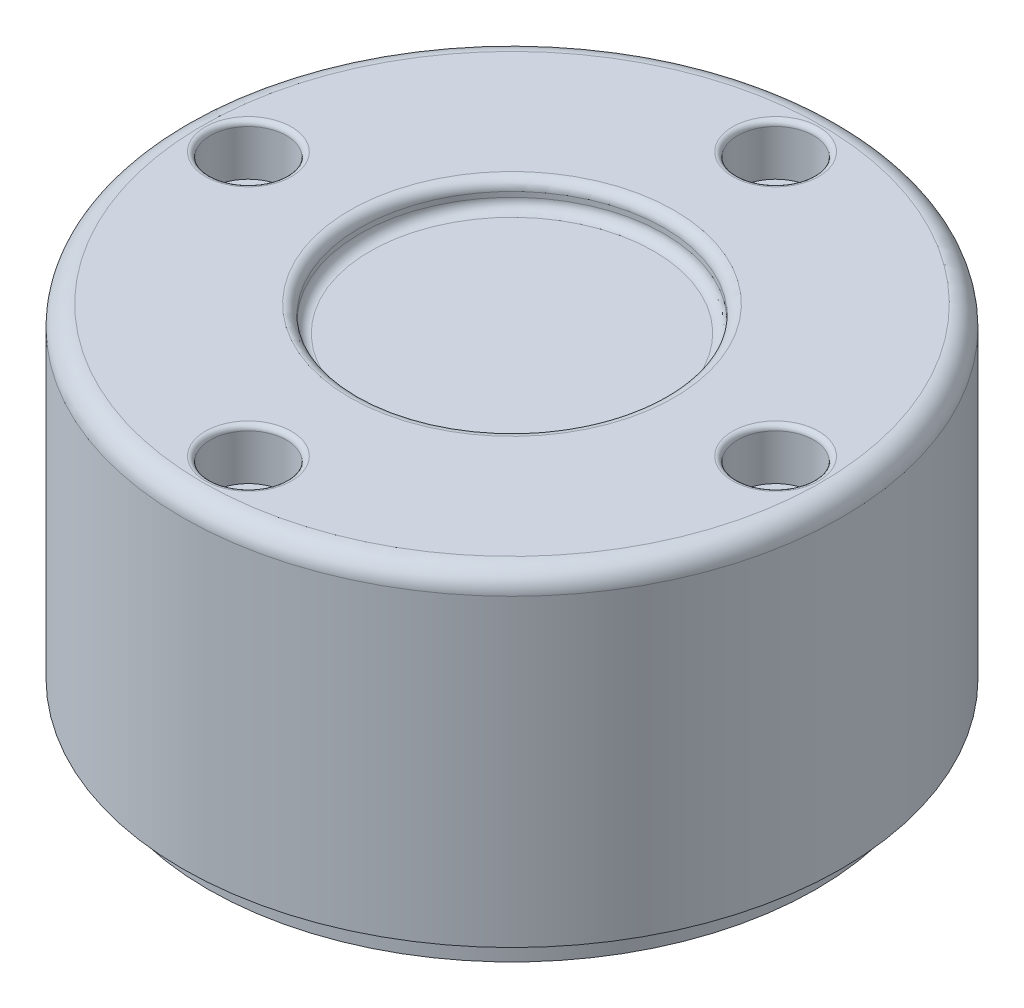
ISO-10303-21;
HEADER;
FILE_DESCRIPTION(('STEP AP214'),'2;1');
FILE_NAME('part.step','',(''),(''),'','','');
FILE_SCHEMA(('AUTOMOTIVE_DESIGN { 1 0 10303 214 1 1 1 1 }'));
ENDSEC;
DATA;
#1=APPLICATION_CONTEXT('core data for automotive mechanical design processes');
#2=APPLICATION_PROTOCOL_DEFINITION('international standard','automotive_design',2000,#1);
#3=PRODUCT_CONTEXT('',#1,'mechanical');
#4=PRODUCT('Part','Part','',(#3));
#5=PRODUCT_RELATED_PRODUCT_CATEGORY('part','',(#4));
#6=PRODUCT_DEFINITION_FORMATION('','',#4);
#7=PRODUCT_DEFINITION_CONTEXT('part definition',#1,'design');
#8=PRODUCT_DEFINITION('design','',#6,#7);
#9=PRODUCT_DEFINITION_SHAPE('','',#8);
#10=(LENGTH_UNIT() NAMED_UNIT(*) SI_UNIT(.MILLI.,.METRE.));
#11=(NAMED_UNIT(*) PLANE_ANGLE_UNIT() SI_UNIT($,.RADIAN.));
#12=(NAMED_UNIT(*) SI_UNIT($,.STERADIAN.) SOLID_ANGLE_UNIT());
#13=UNCERTAINTY_MEASURE_WITH_UNIT(LENGTH_MEASURE(1.E-05),#10,'distance_accuracy_value','');
#14=(GEOMETRIC_REPRESENTATION_CONTEXT(3) GLOBAL_UNCERTAINTY_ASSIGNED_CONTEXT((#13)) GLOBAL_UNIT_ASSIGNED_CONTEXT((#10,
#11,#12)) REPRESENTATION_CONTEXT('',''));
#15=CARTESIAN_POINT('',(0.,0.,0.));
#16=DIRECTION('',(0.,0.,1.));
#17=DIRECTION('',(1.,0.,0.));
#18=AXIS2_PLACEMENT_3D('',#15,#16,#17);
#19=CARTESIAN_POINT('',(0.,3.,0.));
#20=DIRECTION('',(0.,-1.,0.));
#21=DIRECTION('',(0.,0.,-1.));
#22=AXIS2_PLACEMENT_3D('',#19,#20,#21);
#23=CYLINDRICAL_SURFACE('',#22,30.);
#24=CARTESIAN_POINT('',(0.,3.,0.));
#25=DIRECTION('',(0.,1.,0.));
#26=DIRECTION('',(0.,0.,1.));
#27=AXIS2_PLACEMENT_3D('',#24,#25,#26);
#28=CIRCLE('',#27,30.);
#29=CARTESIAN_POINT('',(0.,3.,30.));
#30=VERTEX_POINT('',#29);
#31=EDGE_CURVE('E92',#30,#30,#28,.T.);
#32=ORIENTED_EDGE('',*,*,#31,.F.);
#33=EDGE_LOOP('',(#32));
#34=FACE_BOUND('',#33,.T.);
#35=CARTESIAN_POINT('',(0.,0.,0.));
#36=DIRECTION('',(0.,1.,0.));
#37=DIRECTION('',(0.,0.,1.));
#38=AXIS2_PLACEMENT_3D('',#35,#36,#37);
#39=CIRCLE('',#38,30.);
#40=CARTESIAN_POINT('',(0.,0.,30.));
#41=VERTEX_POINT('',#40);
#42=EDGE_CURVE('E93',#41,#41,#39,.T.);
#43=ORIENTED_EDGE('',*,*,#42,.T.);
#44=EDGE_LOOP('',(#43));
#45=FACE_BOUND('',#44,.T.);
#46=ADVANCED_FACE('F42',(#34,#45),#23,.T.);
#47=CARTESIAN_POINT('',(0.,0.,0.));
#48=DIRECTION('',(0.,1.,0.));
#49=DIRECTION('',(0.,0.,1.));
#50=AXIS2_PLACEMENT_3D('',#47,#48,#49);
#51=PLANE('',#50);
#52=ORIENTED_EDGE('',*,*,#42,.F.);
#53=EDGE_LOOP('',(#52));
#54=FACE_BOUND('',#53,.T.);
#55=ADVANCED_FACE('F131',(#54),#51,.F.);
#56=CARTESIAN_POINT('',(0.,35.,0.));
#57=DIRECTION('',(0.,-1.,0.));
#58=DIRECTION('',(0.,0.,-1.));
#59=AXIS2_PLACEMENT_3D('',#56,#57,#58);
#60=CYLINDRICAL_SURFACE('',#59,32.5);
#61=CARTESIAN_POINT('',(0.,33.,0.));
#62=DIRECTION('',(0.,1.,0.));
#63=DIRECTION('',(0.,0.,1.));
#64=AXIS2_PLACEMENT_3D('',#61,#62,#63);
#65=CIRCLE('',#64,32.5);
#66=CARTESIAN_POINT('',(0.,33.,32.5));
#67=VERTEX_POINT('',#66);
#68=EDGE_CURVE('E74',#67,#67,#65,.F.);
#69=ORIENTED_EDGE('',*,*,#68,.T.);
#70=EDGE_LOOP('',(#69));
#71=FACE_BOUND('',#70,.T.);
#72=CARTESIAN_POINT('',(0.,3.,0.));
#73=DIRECTION('',(0.,1.,0.));
#74=DIRECTION('',(0.,0.,1.));
#75=AXIS2_PLACEMENT_3D('',#72,#73,#74);
#76=CIRCLE('',#75,32.5);
#77=CARTESIAN_POINT('',(0.,3.,32.5));
#78=VERTEX_POINT('',#77);
#79=EDGE_CURVE('E96',#78,#78,#76,.T.);
#80=ORIENTED_EDGE('',*,*,#79,.T.);
#81=EDGE_LOOP('',(#80));
#82=FACE_BOUND('',#81,.T.);
#83=ADVANCED_FACE('F137',(#71,#82),#60,.T.);
#84=CARTESIAN_POINT('',(0.,35.,0.));
#85=DIRECTION('',(0.,1.,0.));
#86=DIRECTION('',(0.,0.,1.));
#87=AXIS2_PLACEMENT_3D('',#84,#85,#86);
#88=PLANE('',#87);
#89=CARTESIAN_POINT('',(26.,35.,0.));
#90=DIRECTION('',(0.,1.,0.));
#91=DIRECTION('',(0.,0.,1.));
#92=AXIS2_PLACEMENT_3D('',#89,#90,#91);
#93=CIRCLE('',#92,4.25);
#94=CARTESIAN_POINT('',(26.,35.,4.25));
#95=VERTEX_POINT('',#94);
#96=EDGE_CURVE('E57',#95,#95,#93,.F.);
#97=ORIENTED_EDGE('',*,*,#96,.T.);
#98=EDGE_LOOP('',(#97));
#99=FACE_BOUND('',#98,.T.);
#100=CARTESIAN_POINT('',(0.,35.,-26.));
#101=DIRECTION('',(0.,1.,0.));
#102=DIRECTION('',(0.,0.,1.));
#103=AXIS2_PLACEMENT_3D('',#100,#101,#102);
#104=CIRCLE('',#103,4.25);
#105=CARTESIAN_POINT('',(0.,35.,-21.75));
#106=VERTEX_POINT('',#105);
#107=EDGE_CURVE('E62',#106,#106,#104,.F.);
#108=ORIENTED_EDGE('',*,*,#107,.T.);
#109=EDGE_LOOP('',(#108));
#110=FACE_BOUND('',#109,.T.);
#111=CARTESIAN_POINT('',(-26.,35.,0.));
#112=DIRECTION('',(0.,1.,0.));
#113=DIRECTION('',(0.,0.,1.));
#114=AXIS2_PLACEMENT_3D('',#111,#112,#113);
#115=CIRCLE('',#114,4.25);
#116=CARTESIAN_POINT('',(-26.,35.,4.25000000000001));
#117=VERTEX_POINT('',#116);
#118=EDGE_CURVE('E65',#117,#117,#115,.F.);
#119=ORIENTED_EDGE('',*,*,#118,.T.);
#120=EDGE_LOOP('',(#119));
#121=FACE_BOUND('',#120,.T.);
#122=CARTESIAN_POINT('',(0.,35.,26.));
#123=DIRECTION('',(0.,1.,0.));
#124=DIRECTION('',(0.,0.,1.));
#125=AXIS2_PLACEMENT_3D('',#122,#123,#124);
#126=CIRCLE('',#125,4.25000000000001);
#127=CARTESIAN_POINT('',(0.,35.,30.25));
#128=VERTEX_POINT('',#127);
#129=EDGE_CURVE('E68',#128,#128,#126,.F.);
#130=ORIENTED_EDGE('',*,*,#129,.T.);
#131=EDGE_LOOP('',(#130));
#132=FACE_BOUND('',#131,.T.);
#133=CARTESIAN_POINT('',(0.,35.,0.));
#134=DIRECTION('',(0.,1.,0.));
#135=DIRECTION('',(0.,0.,1.));
#136=AXIS2_PLACEMENT_3D('',#133,#134,#135);
#137=CIRCLE('',#136,30.5);
#138=CARTESIAN_POINT('',(0.,35.,30.5));
#139=VERTEX_POINT('',#138);
#140=EDGE_CURVE('E77',#139,#139,#137,.T.);
#141=ORIENTED_EDGE('',*,*,#140,.T.);
#142=EDGE_LOOP('',(#141));
#143=FACE_BOUND('',#142,.T.);
#144=CARTESIAN_POINT('',(0.,35.,0.));
#145=DIRECTION('',(0.,1.,0.));
#146=DIRECTION('',(0.,0.,1.));
#147=AXIS2_PLACEMENT_3D('',#144,#145,#146);
#148=CIRCLE('',#147,16.);
#149=CARTESIAN_POINT('',(0.,35.,16.));
#150=VERTEX_POINT('',#149);
#151=EDGE_CURVE('E80',#150,#150,#148,.F.);
#152=ORIENTED_EDGE('',*,*,#151,.T.);
#153=EDGE_LOOP('',(#152));
#154=FACE_BOUND('',#153,.T.);
#155=ADVANCED_FACE('F172',(#99,#110,#121,#132,#143,#154),#88,.T.);
#156=CARTESIAN_POINT('',(0.,3.,0.));
#157=DIRECTION('',(0.,1.,0.));
#158=DIRECTION('',(0.,0.,1.));
#159=AXIS2_PLACEMENT_3D('',#156,#157,#158);
#160=PLANE('',#159);
#161=ORIENTED_EDGE('',*,*,#31,.T.);
#162=EDGE_LOOP('',(#161));
#163=FACE_BOUND('',#162,.T.);
#164=ORIENTED_EDGE('',*,*,#79,.F.);
#165=EDGE_LOOP('',(#164));
#166=FACE_BOUND('',#165,.T.);
#167=ADVANCED_FACE('F175',(#163,#166),#160,.F.);
#168=CARTESIAN_POINT('',(0.,32.5,0.));
#169=DIRECTION('',(0.,1.,0.));
#170=DIRECTION('',(0.,0.,1.));
#171=AXIS2_PLACEMENT_3D('',#168,#169,#170);
#172=CYLINDRICAL_SURFACE('',#171,15.);
#173=CARTESIAN_POINT('',(0.,34.,0.));
#174=DIRECTION('',(0.,1.,0.));
#175=DIRECTION('',(0.,0.,1.));
#176=AXIS2_PLACEMENT_3D('',#173,#174,#175);
#177=CIRCLE('',#176,15.);
#178=CARTESIAN_POINT('',(0.,34.,15.));
#179=VERTEX_POINT('',#178);
#180=EDGE_CURVE('E83',#179,#179,#177,.T.);
#181=ORIENTED_EDGE('',*,*,#180,.T.);
#182=EDGE_LOOP('',(#181));
#183=FACE_BOUND('',#182,.T.);
#184=CARTESIAN_POINT('',(0.,33.5,0.));
#185=DIRECTION('',(0.,1.,0.));
#186=DIRECTION('',(0.,0.,1.));
#187=AXIS2_PLACEMENT_3D('',#184,#185,#186);
#188=CIRCLE('',#187,15.);
#189=CARTESIAN_POINT('',(0.,33.5,15.));
#190=VERTEX_POINT('',#189);
#191=EDGE_CURVE('E86',#190,#190,#188,.F.);
#192=ORIENTED_EDGE('',*,*,#191,.T.);
#193=EDGE_LOOP('',(#192));
#194=FACE_BOUND('',#193,.T.);
#195=ADVANCED_FACE('F186',(#183,#194),#172,.F.);
#196=CARTESIAN_POINT('',(0.,32.5,0.));
#197=DIRECTION('',(0.,1.,0.));
#198=DIRECTION('',(0.,0.,1.));
#199=AXIS2_PLACEMENT_3D('',#196,#197,#198);
#200=PLANE('',#199);
#201=CARTESIAN_POINT('',(0.,32.5,0.));
#202=DIRECTION('',(0.,1.,0.));
#203=DIRECTION('',(0.,0.,1.));
#204=AXIS2_PLACEMENT_3D('',#201,#202,#203);
#205=CIRCLE('',#204,14.);
#206=CARTESIAN_POINT('',(0.,32.5,14.));
#207=VERTEX_POINT('',#206);
#208=EDGE_CURVE('E89',#207,#207,#205,.T.);
#209=ORIENTED_EDGE('',*,*,#208,.T.);
#210=EDGE_LOOP('',(#209));
#211=FACE_BOUND('',#210,.T.);
#212=ADVANCED_FACE('F189',(#211),#200,.T.);
#213=CARTESIAN_POINT('',(-26.,30.,0.));
#214=DIRECTION('',(0.,1.,0.));
#215=DIRECTION('',(0.,0.,1.));
#216=AXIS2_PLACEMENT_3D('',#213,#214,#215);
#217=CYLINDRICAL_SURFACE('',#216,3.75);
#218=CARTESIAN_POINT('',(-26.,34.5,0.));
#219=DIRECTION('',(0.,1.,0.));
#220=DIRECTION('',(0.,0.,1.));
#221=AXIS2_PLACEMENT_3D('',#218,#219,#220);
#222=CIRCLE('',#221,3.75);
#223=CARTESIAN_POINT('',(-26.,34.5,3.75));
#224=VERTEX_POINT('',#223);
#225=EDGE_CURVE('E49',#224,#224,#222,.T.);
#226=ORIENTED_EDGE('',*,*,#225,.T.);
#227=EDGE_LOOP('',(#226));
#228=FACE_BOUND('',#227,.T.);
#229=CARTESIAN_POINT('',(-26.,30.,0.));
#230=DIRECTION('',(0.,1.,0.));
#231=DIRECTION('',(0.,0.,1.));
#232=AXIS2_PLACEMENT_3D('',#229,#230,#231);
#233=CIRCLE('',#232,3.75);
#234=CARTESIAN_POINT('',(-26.,30.,3.75));
#235=VERTEX_POINT('',#234);
#236=EDGE_CURVE('E101',#235,#235,#233,.T.);
#237=ORIENTED_EDGE('',*,*,#236,.F.);
#238=EDGE_LOOP('',(#237));
#239=FACE_BOUND('',#238,.T.);
#240=ADVANCED_FACE('F196',(#228,#239),#217,.F.);
#241=CARTESIAN_POINT('',(0.,30.,0.));
#242=DIRECTION('',(0.,1.,0.));
#243=DIRECTION('',(0.,0.,1.));
#244=AXIS2_PLACEMENT_3D('',#241,#242,#243);
#245=PLANE('',#244);
#246=ORIENTED_EDGE('',*,*,#236,.T.);
#247=EDGE_LOOP('',(#246));
#248=FACE_BOUND('',#247,.T.);
#249=ADVANCED_FACE('F201',(#248),#245,.T.);
#250=CARTESIAN_POINT('',(0.,30.,26.));
#251=DIRECTION('',(0.,1.,0.));
#252=DIRECTION('',(0.,0.,1.));
#253=AXIS2_PLACEMENT_3D('',#250,#251,#252);
#254=CYLINDRICAL_SURFACE('',#253,3.75000000000001);
#255=CARTESIAN_POINT('',(0.,34.5,26.));
#256=DIRECTION('',(0.,1.,0.));
#257=DIRECTION('',(0.,0.,1.));
#258=AXIS2_PLACEMENT_3D('',#255,#256,#257);
#259=CIRCLE('',#258,3.75000000000001);
#260=CARTESIAN_POINT('',(0.,34.5,29.75));
#261=VERTEX_POINT('',#260);
#262=EDGE_CURVE('E12',#261,#261,#259,.T.);
#263=ORIENTED_EDGE('',*,*,#262,.T.);
#264=EDGE_LOOP('',(#263));
#265=FACE_BOUND('',#264,.T.);
#266=CARTESIAN_POINT('',(0.,30.,26.));
#267=DIRECTION('',(0.,1.,0.));
#268=DIRECTION('',(0.,0.,1.));
#269=AXIS2_PLACEMENT_3D('',#266,#267,#268);
#270=CIRCLE('',#269,3.75000000000001);
#271=CARTESIAN_POINT('',(0.,30.,29.75));
#272=VERTEX_POINT('',#271);
#273=EDGE_CURVE('E105',#272,#272,#270,.T.);
#274=ORIENTED_EDGE('',*,*,#273,.F.);
#275=EDGE_LOOP('',(#274));
#276=FACE_BOUND('',#275,.T.);
#277=ADVANCED_FACE('F294',(#265,#276),#254,.F.);
#278=CARTESIAN_POINT('',(0.,30.,26.));
#279=DIRECTION('',(0.,1.,0.));
#280=DIRECTION('',(0.,0.,1.));
#281=AXIS2_PLACEMENT_3D('',#278,#279,#280);
#282=PLANE('',#281);
#283=ORIENTED_EDGE('',*,*,#273,.T.);
#284=EDGE_LOOP('',(#283));
#285=FACE_BOUND('',#284,.T.);
#286=ADVANCED_FACE('F286',(#285),#282,.T.);
#287=CARTESIAN_POINT('',(26.,30.,0.));
#288=DIRECTION('',(0.,1.,0.));
#289=DIRECTION('',(0.,0.,1.));
#290=AXIS2_PLACEMENT_3D('',#287,#288,#289);
#291=CYLINDRICAL_SURFACE('',#290,3.75);
#292=CARTESIAN_POINT('',(26.,34.5,0.));
#293=DIRECTION('',(0.,1.,0.));
#294=DIRECTION('',(0.,0.,1.));
#295=AXIS2_PLACEMENT_3D('',#292,#293,#294);
#296=CIRCLE('',#295,3.75);
#297=CARTESIAN_POINT('',(26.,34.5,3.75));
#298=VERTEX_POINT('',#297);
#299=EDGE_CURVE('E71',#298,#298,#296,.T.);
#300=ORIENTED_EDGE('',*,*,#299,.T.);
#301=EDGE_LOOP('',(#300));
#302=FACE_BOUND('',#301,.T.);
#303=CARTESIAN_POINT('',(26.,30.,0.));
#304=DIRECTION('',(0.,1.,0.));
#305=DIRECTION('',(0.,0.,1.));
#306=AXIS2_PLACEMENT_3D('',#303,#304,#305);
#307=CIRCLE('',#306,3.75);
#308=CARTESIAN_POINT('',(26.,30.,3.75));
#309=VERTEX_POINT('',#308);
#310=EDGE_CURVE('E108',#309,#309,#307,.T.);
#311=ORIENTED_EDGE('',*,*,#310,.F.);
#312=EDGE_LOOP('',(#311));
#313=FACE_BOUND('',#312,.T.);
#314=ADVANCED_FACE('F127',(#302,#313),#291,.F.);
#315=CARTESIAN_POINT('',(0.,30.,0.));
#316=DIRECTION('',(0.,1.,0.));
#317=DIRECTION('',(0.,0.,1.));
#318=AXIS2_PLACEMENT_3D('',#315,#316,#317);
#319=PLANE('',#318);
#320=ORIENTED_EDGE('',*,*,#310,.T.);
#321=EDGE_LOOP('',(#320));
#322=FACE_BOUND('',#321,.T.);
#323=ADVANCED_FACE('F118',(#322),#319,.T.);
#324=CARTESIAN_POINT('',(0.,30.,-26.));
#325=DIRECTION('',(0.,1.,0.));
#326=DIRECTION('',(0.,0.,1.));
#327=AXIS2_PLACEMENT_3D('',#324,#325,#326);
#328=CYLINDRICAL_SURFACE('',#327,3.75);
#329=CARTESIAN_POINT('',(0.,34.5,-26.));
#330=DIRECTION('',(0.,1.,0.));
#331=DIRECTION('',(0.,0.,1.));
#332=AXIS2_PLACEMENT_3D('',#329,#330,#331);
#333=CIRCLE('',#332,3.75);
#334=CARTESIAN_POINT('',(0.,34.5,-22.25));
#335=VERTEX_POINT('',#334);
#336=EDGE_CURVE('E53',#335,#335,#333,.T.);
#337=ORIENTED_EDGE('',*,*,#336,.T.);
#338=EDGE_LOOP('',(#337));
#339=FACE_BOUND('',#338,.T.);
#340=CARTESIAN_POINT('',(0.,30.,-26.));
#341=DIRECTION('',(0.,1.,0.));
#342=DIRECTION('',(0.,0.,1.));
#343=AXIS2_PLACEMENT_3D('',#340,#341,#342);
#344=CIRCLE('',#343,3.75);
#345=CARTESIAN_POINT('',(0.,30.,-22.25));
#346=VERTEX_POINT('',#345);
#347=EDGE_CURVE('E104',#346,#346,#344,.T.);
#348=ORIENTED_EDGE('',*,*,#347,.F.);
#349=EDGE_LOOP('',(#348));
#350=FACE_BOUND('',#349,.T.);
#351=ADVANCED_FACE('F116',(#339,#350),#328,.F.);
#352=CARTESIAN_POINT('',(0.,30.,0.));
#353=DIRECTION('',(0.,1.,0.));
#354=DIRECTION('',(0.,0.,1.));
#355=AXIS2_PLACEMENT_3D('',#352,#353,#354);
#356=PLANE('',#355);
#357=ORIENTED_EDGE('',*,*,#347,.T.);
#358=EDGE_LOOP('',(#357));
#359=FACE_BOUND('',#358,.T.);
#360=ADVANCED_FACE('F114',(#359),#356,.T.);
#361=CARTESIAN_POINT('',(0.,33.5,0.));
#362=DIRECTION('',(0.,1.,0.));
#363=DIRECTION('',(0.,0.,1.));
#364=AXIS2_PLACEMENT_3D('',#361,#362,#363);
#365=TOROIDAL_SURFACE('',#364,14.,1.);
#366=ORIENTED_EDGE('',*,*,#191,.F.);
#367=EDGE_LOOP('',(#366));
#368=FACE_BOUND('',#367,.T.);
#369=ORIENTED_EDGE('',*,*,#208,.F.);
#370=EDGE_LOOP('',(#369));
#371=FACE_BOUND('',#370,.T.);
#372=ADVANCED_FACE('F125',(#368,#371),#365,.F.);
#373=CARTESIAN_POINT('',(0.,34.,0.));
#374=DIRECTION('',(0.,1.,0.));
#375=DIRECTION('',(0.,0.,1.));
#376=AXIS2_PLACEMENT_3D('',#373,#374,#375);
#377=TOROIDAL_SURFACE('',#376,16.,1.);
#378=ORIENTED_EDGE('',*,*,#151,.F.);
#379=EDGE_LOOP('',(#378));
#380=FACE_BOUND('',#379,.T.);
#381=ORIENTED_EDGE('',*,*,#180,.F.);
#382=EDGE_LOOP('',(#381));
#383=FACE_BOUND('',#382,.T.);
#384=ADVANCED_FACE('F146',(#380,#383),#377,.T.);
#385=CARTESIAN_POINT('',(0.,33.,0.));
#386=DIRECTION('',(0.,1.,0.));
#387=DIRECTION('',(0.,0.,1.));
#388=AXIS2_PLACEMENT_3D('',#385,#386,#387);
#389=TOROIDAL_SURFACE('',#388,30.5,2.);
#390=ORIENTED_EDGE('',*,*,#68,.F.);
#391=EDGE_LOOP('',(#390));
#392=FACE_BOUND('',#391,.T.);
#393=ORIENTED_EDGE('',*,*,#140,.F.);
#394=EDGE_LOOP('',(#393));
#395=FACE_BOUND('',#394,.T.);
#396=ADVANCED_FACE('F150',(#392,#395),#389,.T.);
#397=CARTESIAN_POINT('',(26.,34.5,0.));
#398=DIRECTION('',(0.,1.,0.));
#399=DIRECTION('',(0.,0.,1.));
#400=AXIS2_PLACEMENT_3D('',#397,#398,#399);
#401=TOROIDAL_SURFACE('',#400,4.25,0.5);
#402=ORIENTED_EDGE('',*,*,#96,.F.);
#403=EDGE_LOOP('',(#402));
#404=FACE_BOUND('',#403,.T.);
#405=ORIENTED_EDGE('',*,*,#299,.F.);
#406=EDGE_LOOP('',(#405));
#407=FACE_BOUND('',#406,.T.);
#408=ADVANCED_FACE('F154',(#404,#407),#401,.T.);
#409=CARTESIAN_POINT('',(0.,34.5,-26.));
#410=DIRECTION('',(0.,1.,0.));
#411=DIRECTION('',(0.,0.,1.));
#412=AXIS2_PLACEMENT_3D('',#409,#410,#411);
#413=TOROIDAL_SURFACE('',#412,4.25,0.5);
#414=ORIENTED_EDGE('',*,*,#107,.F.);
#415=EDGE_LOOP('',(#414));
#416=FACE_BOUND('',#415,.T.);
#417=ORIENTED_EDGE('',*,*,#336,.F.);
#418=EDGE_LOOP('',(#417));
#419=FACE_BOUND('',#418,.T.);
#420=ADVANCED_FACE('F158',(#416,#419),#413,.T.);
#421=CARTESIAN_POINT('',(-26.,34.5,0.));
#422=DIRECTION('',(0.,1.,0.));
#423=DIRECTION('',(0.,0.,1.));
#424=AXIS2_PLACEMENT_3D('',#421,#422,#423);
#425=TOROIDAL_SURFACE('',#424,4.25,0.5);
#426=ORIENTED_EDGE('',*,*,#118,.F.);
#427=EDGE_LOOP('',(#426));
#428=FACE_BOUND('',#427,.T.);
#429=ORIENTED_EDGE('',*,*,#225,.F.);
#430=EDGE_LOOP('',(#429));
#431=FACE_BOUND('',#430,.T.);
#432=ADVANCED_FACE('F161',(#428,#431),#425,.T.);
#433=CARTESIAN_POINT('',(0.,34.5,26.));
#434=DIRECTION('',(0.,1.,0.));
#435=DIRECTION('',(0.,0.,1.));
#436=AXIS2_PLACEMENT_3D('',#433,#434,#435);
#437=TOROIDAL_SURFACE('',#436,4.25000000000001,0.5);
#438=ORIENTED_EDGE('',*,*,#129,.F.);
#439=EDGE_LOOP('',(#438));
#440=FACE_BOUND('',#439,.T.);
#441=ORIENTED_EDGE('',*,*,#262,.F.);
#442=EDGE_LOOP('',(#441));
#443=FACE_BOUND('',#442,.T.);
#444=ADVANCED_FACE('F44',(#440,#443),#437,.T.);
#445=CLOSED_SHELL('',(#46,#55,#83,#155,#167,#195,#212,#240,#249,#277,#286,#314,#323,#351,#360,
#372,#384,#396,#408,#420,#432,#444));
#446=MANIFOLD_SOLID_BREP('B2',#445);
#447=ADVANCED_BREP_SHAPE_REPRESENTATION('',(#18,#446),#14);
#448=SHAPE_DEFINITION_REPRESENTATION(#9,#447);
ENDSEC;
END-ISO-10303-21;
